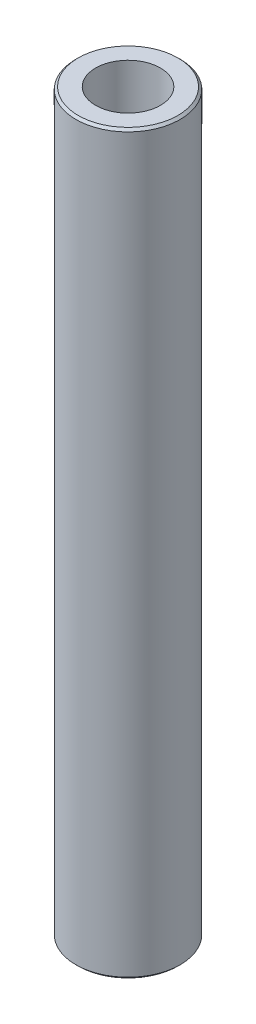
ISO-10303-21;
HEADER;
FILE_DESCRIPTION(('STEP AP214'),'2;1');
FILE_NAME('part.step','',(''),(''),'','','');
FILE_SCHEMA(('AUTOMOTIVE_DESIGN { 1 0 10303 214 1 1 1 1 }'));
ENDSEC;
DATA;
#1=APPLICATION_CONTEXT('core data for automotive mechanical design processes');
#2=APPLICATION_PROTOCOL_DEFINITION('international standard','automotive_design',2000,#1);
#3=PRODUCT_CONTEXT('',#1,'mechanical');
#4=PRODUCT('Part','Part','',(#3));
#5=PRODUCT_RELATED_PRODUCT_CATEGORY('part','',(#4));
#6=PRODUCT_DEFINITION_FORMATION('','',#4);
#7=PRODUCT_DEFINITION_CONTEXT('part definition',#1,'design');
#8=PRODUCT_DEFINITION('design','',#6,#7);
#9=PRODUCT_DEFINITION_SHAPE('','',#8);
#10=(LENGTH_UNIT() NAMED_UNIT(*) SI_UNIT(.MILLI.,.METRE.));
#11=(NAMED_UNIT(*) PLANE_ANGLE_UNIT() SI_UNIT($,.RADIAN.));
#12=(NAMED_UNIT(*) SI_UNIT($,.STERADIAN.) SOLID_ANGLE_UNIT());
#13=UNCERTAINTY_MEASURE_WITH_UNIT(LENGTH_MEASURE(1.E-05),#10,'distance_accuracy_value','');
#14=(GEOMETRIC_REPRESENTATION_CONTEXT(3) GLOBAL_UNCERTAINTY_ASSIGNED_CONTEXT((#13)) GLOBAL_UNIT_ASSIGNED_CONTEXT((#10,
#11,#12)) REPRESENTATION_CONTEXT('',''));
#15=CARTESIAN_POINT('',(0.,0.,0.));
#16=DIRECTION('',(0.,0.,1.));
#17=DIRECTION('',(1.,0.,0.));
#18=AXIS2_PLACEMENT_3D('',#15,#16,#17);
#19=CARTESIAN_POINT('',(0.,600.,0.));
#20=DIRECTION('',(0.,-1.,0.));
#21=DIRECTION('',(0.,0.,-1.));
#22=AXIS2_PLACEMENT_3D('',#19,#20,#21);
#23=CYLINDRICAL_SURFACE('',#22,42.5);
#24=CARTESIAN_POINT('',(0.,598.117307590432,0.));
#25=DIRECTION('',(0.,1.,0.));
#26=DIRECTION('',(0.,0.,1.));
#27=AXIS2_PLACEMENT_3D('',#24,#25,#26);
#28=CIRCLE('',#27,42.5);
#29=CARTESIAN_POINT('',(0.,598.117307590432,-42.5));
#30=VERTEX_POINT('',#29);
#31=EDGE_CURVE('E50',#30,#30,#28,.F.);
#32=CARTESIAN_POINT('',(0.,1.8826924095684,0.));
#33=DIRECTION('',(0.,1.,0.));
#34=DIRECTION('',(0.,0.,1.));
#35=AXIS2_PLACEMENT_3D('',#32,#33,#34);
#36=CIRCLE('',#35,42.5);
#37=CARTESIAN_POINT('',(0.,1.8826924095684,-42.5));
#38=VERTEX_POINT('',#37);
#39=EDGE_CURVE('E51',#38,#38,#36,.T.);
#40=CARTESIAN_POINT('',(0.,598.117307590432,-42.5));
#41=CARTESIAN_POINT('',(0.,591.906530348965,-42.5));
#42=CARTESIAN_POINT('',(0.,585.695753107497,-42.5));
#43=CARTESIAN_POINT('',(0.,573.274198624563,-42.5));
#44=CARTESIAN_POINT('',(0.,567.063421383095,-42.5));
#45=CARTESIAN_POINT('',(0.,554.641866900161,-42.5));
#46=CARTESIAN_POINT('',(0.,548.431089658693,-42.5));
#47=CARTESIAN_POINT('',(0.,536.009535175759,-42.5));
#48=CARTESIAN_POINT('',(0.,529.798757934291,-42.5));
#49=CARTESIAN_POINT('',(0.,517.377203451357,-42.5));
#50=CARTESIAN_POINT('',(0.,511.166426209889,-42.5));
#51=CARTESIAN_POINT('',(0.,498.744871726955,-42.5));
#52=CARTESIAN_POINT('',(0.,492.534094485487,-42.5));
#53=CARTESIAN_POINT('',(0.,480.112540002553,-42.5));
#54=CARTESIAN_POINT('',(0.,473.901762761085,-42.5));
#55=CARTESIAN_POINT('',(0.,461.480208278151,-42.5));
#56=CARTESIAN_POINT('',(0.,455.269431036683,-42.5));
#57=CARTESIAN_POINT('',(0.,442.847876553749,-42.5));
#58=CARTESIAN_POINT('',(0.,436.637099312281,-42.5));
#59=CARTESIAN_POINT('',(0.,424.215544829347,-42.5));
#60=CARTESIAN_POINT('',(0.,418.004767587879,-42.5));
#61=CARTESIAN_POINT('',(0.,405.583213104945,-42.5));
#62=CARTESIAN_POINT('',(0.,399.372435863478,-42.5));
#63=CARTESIAN_POINT('',(0.,386.950881380543,-42.5));
#64=CARTESIAN_POINT('',(0.,380.740104139075,-42.5));
#65=CARTESIAN_POINT('',(0.,368.318549656141,-42.5));
#66=CARTESIAN_POINT('',(0.,362.107772414673,-42.5));
#67=CARTESIAN_POINT('',(0.,349.686217931739,-42.5));
#68=CARTESIAN_POINT('',(0.,343.475440690272,-42.5));
#69=CARTESIAN_POINT('',(0.,331.053886207337,-42.5));
#70=CARTESIAN_POINT('',(0.,324.84310896587,-42.5));
#71=CARTESIAN_POINT('',(0.,312.421554482935,-42.5));
#72=CARTESIAN_POINT('',(0.,306.210777241468,-42.5));
#73=CARTESIAN_POINT('',(0.,293.789222758533,-42.5));
#74=CARTESIAN_POINT('',(0.,287.578445517066,-42.5));
#75=CARTESIAN_POINT('',(0.,275.156891034131,-42.5));
#76=CARTESIAN_POINT('',(0.,268.946113792664,-42.5));
#77=CARTESIAN_POINT('',(0.,256.524559309729,-42.5));
#78=CARTESIAN_POINT('',(0.,250.313782068262,-42.5));
#79=CARTESIAN_POINT('',(0.,237.892227585327,-42.5));
#80=CARTESIAN_POINT('',(0.,231.68145034386,-42.5));
#81=CARTESIAN_POINT('',(0.,219.259895860925,-42.5));
#82=CARTESIAN_POINT('',(0.,213.049118619458,-42.5));
#83=CARTESIAN_POINT('',(0.,200.627564136523,-42.5));
#84=CARTESIAN_POINT('',(0.,194.416786895056,-42.5));
#85=CARTESIAN_POINT('',(0.,181.995232412121,-42.5));
#86=CARTESIAN_POINT('',(0.,175.784455170654,-42.5));
#87=CARTESIAN_POINT('',(0.,163.362900687719,-42.5));
#88=CARTESIAN_POINT('',(0.,157.152123446252,-42.5));
#89=CARTESIAN_POINT('',(0.,144.730568963317,-42.5));
#90=CARTESIAN_POINT('',(0.,138.51979172185,-42.5));
#91=CARTESIAN_POINT('',(0.,126.098237238915,-42.5));
#92=CARTESIAN_POINT('',(0.,119.887459997448,-42.5));
#93=CARTESIAN_POINT('',(0.,107.465905514513,-42.5));
#94=CARTESIAN_POINT('',(0.,101.255128273046,-42.5));
#95=CARTESIAN_POINT('',(0.,88.833573790111,-42.5));
#96=CARTESIAN_POINT('',(0.,82.6227965486436,-42.5));
#97=CARTESIAN_POINT('',(0.,70.201242065709,-42.5));
#98=CARTESIAN_POINT('',(0.,63.9904648242417,-42.5));
#99=CARTESIAN_POINT('',(0.,51.5689103413071,-42.5));
#100=CARTESIAN_POINT('',(0.,45.3581330998398,-42.5));
#101=CARTESIAN_POINT('',(0.,32.9365786169051,-42.5));
#102=CARTESIAN_POINT('',(0.,26.7258013754377,-42.5));
#103=CARTESIAN_POINT('',(0.,14.304246892503,-42.5));
#104=CARTESIAN_POINT('',(0.,8.09346965103571,-42.5));
#105=CARTESIAN_POINT('',(0.,1.8826924095684,-42.5));
#106=B_SPLINE_CURVE_WITH_KNOTS('',3,(#40,#41,#42,#43,#44,#45,#46,#47,#48,#49,#50,#51,#52,#53,
#54,#55,#56,#57,#58,#59,#60,#61,#62,#63,#64,#65,#66,#67,#68,#69,#70,#71,#72,#73,#74,#75,#76,#77,
#78,#79,#80,#81,#82,#83,#84,#85,#86,#87,#88,#89,#90,#91,#92,#93,#94,#95,#96,#97,#98,#99,#100,
#101,#102,#103,#104,#105),.UNSPECIFIED.,.F.,.F.,(4,2,2,2,2,2,2,2,2,2,2,2,2,2,2,2,2,2,2,2,2,2,2,
2,2,2,2,2,2,2,2,2,4),(0.,18.632331724402,37.2646634488041,55.896995173206,74.5293268976079,
93.16165862201,111.793990346412,130.426322070814,149.058653795216,167.690985519618,
186.32331724402,204.955648968422,223.587980692824,242.220312417226,260.852644141628,
279.48497586603,298.117307590432,316.749639314834,335.381971039236,354.014302763638,
372.64663448804,391.278966212442,409.911297936844,428.543629661246,447.175961385648,
465.80829311005,484.440624834452,503.072956558854,521.705288283256,540.337620007658,
558.96995173206,577.602283456462,596.234615180864),.UNSPECIFIED.);
#107=EDGE_CURVE('BSEAM39',#30,#38,#106,.T.);
#108=ORIENTED_EDGE('',*,*,#31,.T.);
#109=ORIENTED_EDGE('',*,*,#39,.T.);
#110=ORIENTED_EDGE('',*,*,#107,.T.);
#111=ORIENTED_EDGE('',*,*,#107,.F.);
#112=EDGE_LOOP('',(#108,#110,#109,#111));
#113=FACE_BOUND('',#112,.T.);
#114=ADVANCED_FACE('F39',(#113),#23,.T.);
#115=CARTESIAN_POINT('',(0.,600.,0.));
#116=DIRECTION('',(0.,1.,0.));
#117=DIRECTION('',(0.,0.,1.));
#118=AXIS2_PLACEMENT_3D('',#115,#116,#117);
#119=PLANE('',#118);
#120=CARTESIAN_POINT('',(0.,600.,0.));
#121=DIRECTION('',(0.,1.,0.));
#122=DIRECTION('',(0.,0.,1.));
#123=AXIS2_PLACEMENT_3D('',#120,#121,#122);
#124=CIRCLE('',#123,40.6173075904319);
#125=CARTESIAN_POINT('',(0.,600.,-40.617307590432));
#126=VERTEX_POINT('',#125);
#127=EDGE_CURVE('E54',#126,#126,#124,.T.);
#128=ORIENTED_EDGE('',*,*,#127,.T.);
#129=EDGE_LOOP('',(#128));
#130=FACE_BOUND('',#129,.T.);
#131=CARTESIAN_POINT('',(0.,600.,0.));
#132=DIRECTION('',(0.,1.,0.));
#133=DIRECTION('',(0.,0.,1.));
#134=AXIS2_PLACEMENT_3D('',#131,#132,#133);
#135=CIRCLE('',#134,26.3985043452095);
#136=CARTESIAN_POINT('',(0.,600.,26.3985043452095));
#137=VERTEX_POINT('',#136);
#138=EDGE_CURVE('E58',#137,#137,#135,.T.);
#139=ORIENTED_EDGE('',*,*,#138,.F.);
#140=EDGE_LOOP('',(#139));
#141=FACE_BOUND('',#140,.T.);
#142=ADVANCED_FACE('F69',(#130,#141),#119,.T.);
#143=CARTESIAN_POINT('',(0.,0.,0.));
#144=DIRECTION('',(0.,1.,0.));
#145=DIRECTION('',(0.,0.,1.));
#146=AXIS2_PLACEMENT_3D('',#143,#144,#145);
#147=PLANE('',#146);
#148=CARTESIAN_POINT('',(0.,0.,0.));
#149=DIRECTION('',(0.,1.,0.));
#150=DIRECTION('',(0.,0.,1.));
#151=AXIS2_PLACEMENT_3D('',#148,#149,#150);
#152=CIRCLE('',#151,40.6173075904316);
#153=CARTESIAN_POINT('',(0.,0.,40.6173075904316));
#154=VERTEX_POINT('',#153);
#155=EDGE_CURVE('E10',#154,#154,#152,.F.);
#156=ORIENTED_EDGE('',*,*,#155,.T.);
#157=EDGE_LOOP('',(#156));
#158=FACE_BOUND('',#157,.T.);
#159=CARTESIAN_POINT('',(0.,0.,0.));
#160=DIRECTION('',(0.,1.,0.));
#161=DIRECTION('',(0.,0.,1.));
#162=AXIS2_PLACEMENT_3D('',#159,#160,#161);
#163=CIRCLE('',#162,26.3985043452095);
#164=CARTESIAN_POINT('',(0.,0.,26.3985043452095));
#165=VERTEX_POINT('',#164);
#166=EDGE_CURVE('E63',#165,#165,#163,.T.);
#167=ORIENTED_EDGE('',*,*,#166,.T.);
#168=EDGE_LOOP('',(#167));
#169=FACE_BOUND('',#168,.T.);
#170=ADVANCED_FACE('F75',(#158,#169),#147,.F.);
#171=CARTESIAN_POINT('',(0.,600.,0.));
#172=DIRECTION('',(0.,-1.,0.));
#173=DIRECTION('',(0.,0.,-1.));
#174=AXIS2_PLACEMENT_3D('',#171,#172,#173);
#175=CYLINDRICAL_SURFACE('',#174,26.3985043452095);
#176=ORIENTED_EDGE('',*,*,#138,.T.);
#177=EDGE_LOOP('',(#176));
#178=FACE_BOUND('',#177,.T.);
#179=ORIENTED_EDGE('',*,*,#166,.F.);
#180=EDGE_LOOP('',(#179));
#181=FACE_BOUND('',#180,.T.);
#182=ADVANCED_FACE('F70',(#178,#181),#175,.F.);
#183=CARTESIAN_POINT('',(0.,600.,0.));
#184=DIRECTION('',(0.,-1.,0.));
#185=DIRECTION('',(0.,0.,-1.));
#186=AXIS2_PLACEMENT_3D('',#183,#184,#185);
#187=CONICAL_SURFACE('',#186,40.6173075904319,0.785398163397485);
#188=CARTESIAN_POINT('',(0.,598.117307590432,-42.5000000000001));
#189=CARTESIAN_POINT('',(0.,598.136918969698,-42.4803886207338));
#190=CARTESIAN_POINT('',(0.,598.156530348965,-42.4607772414674));
#191=CARTESIAN_POINT('',(0.,598.195753107497,-42.4215544829347));
#192=CARTESIAN_POINT('',(0.,598.215364486764,-42.4019431036684));
#193=CARTESIAN_POINT('',(0.,598.254587245296,-42.3627203451357));
#194=CARTESIAN_POINT('',(0.,598.274198624563,-42.3431089658694));
#195=CARTESIAN_POINT('',(0.,598.313421383095,-42.3038862073367));
#196=CARTESIAN_POINT('',(0.,598.333032762362,-42.2842748280704));
#197=CARTESIAN_POINT('',(0.,598.372255520894,-42.2450520695377));
#198=CARTESIAN_POINT('',(0.,598.391866900161,-42.2254406902714));
#199=CARTESIAN_POINT('',(0.,598.431089658693,-42.1862179317387));
#200=CARTESIAN_POINT('',(0.,598.45070103796,-42.1666065524724));
#201=CARTESIAN_POINT('',(0.,598.489923796492,-42.1273837939397));
#202=CARTESIAN_POINT('',(0.,598.509535175759,-42.1077724146734));
#203=CARTESIAN_POINT('',(0.,598.548757934291,-42.0685496561407));
#204=CARTESIAN_POINT('',(0.,598.568369313558,-42.0489382768744));
#205=CARTESIAN_POINT('',(0.,598.60759207209,-42.0097155183417));
#206=CARTESIAN_POINT('',(0.,598.627203451357,-41.9901041390754));
#207=CARTESIAN_POINT('',(0.,598.666426209889,-41.9508813805427));
#208=CARTESIAN_POINT('',(0.,598.686037589156,-41.9312700012764));
#209=CARTESIAN_POINT('',(0.,598.725260347688,-41.8920472427437));
#210=CARTESIAN_POINT('',(0.,598.744871726955,-41.8724358634774));
#211=CARTESIAN_POINT('',(0.,598.784094485487,-41.8332131049447));
#212=CARTESIAN_POINT('',(0.,598.803705864754,-41.8136017256784));
#213=CARTESIAN_POINT('',(0.,598.842928623286,-41.7743789671457));
#214=CARTESIAN_POINT('',(0.,598.862540002553,-41.7547675878794));
#215=CARTESIAN_POINT('',(0.,598.901762761085,-41.7155448293467));
#216=CARTESIAN_POINT('',(0.,598.921374140352,-41.6959334500803));
#217=CARTESIAN_POINT('',(0.,598.960596898884,-41.6567106915477));
#218=CARTESIAN_POINT('',(0.,598.980208278151,-41.6370993122814));
#219=CARTESIAN_POINT('',(0.,599.019431036683,-41.5978765537487));
#220=CARTESIAN_POINT('',(0.,599.03904241595,-41.5782651744824));
#221=CARTESIAN_POINT('',(0.,599.078265174482,-41.5390424159497));
#222=CARTESIAN_POINT('',(0.,599.097876553749,-41.5194310366833));
#223=CARTESIAN_POINT('',(0.,599.137099312281,-41.4802082781507));
#224=CARTESIAN_POINT('',(0.,599.156710691548,-41.4605968988844));
#225=CARTESIAN_POINT('',(0.,599.19593345008,-41.4213741403517));
#226=CARTESIAN_POINT('',(0.,599.215544829347,-41.4017627610853));
#227=CARTESIAN_POINT('',(0.,599.254767587879,-41.3625400025527));
#228=CARTESIAN_POINT('',(0.,599.274378967146,-41.3429286232864));
#229=CARTESIAN_POINT('',(0.,599.313601725678,-41.3037058647537));
#230=CARTESIAN_POINT('',(0.,599.333213104945,-41.2840944854873));
#231=CARTESIAN_POINT('',(0.,599.372435863477,-41.2448717269547));
#232=CARTESIAN_POINT('',(0.,599.392047242744,-41.2252603476883));
#233=CARTESIAN_POINT('',(0.,599.431270001276,-41.1860375891557));
#234=CARTESIAN_POINT('',(0.,599.450881380543,-41.1664262098893));
#235=CARTESIAN_POINT('',(0.,599.490104139075,-41.1272034513567));
#236=CARTESIAN_POINT('',(0.,599.509715518342,-41.1075920720903));
#237=CARTESIAN_POINT('',(0.,599.548938276874,-41.0683693135577));
#238=CARTESIAN_POINT('',(0.,599.568549656141,-41.0487579342913));
#239=CARTESIAN_POINT('',(0.,599.607772414673,-41.0095351757586));
#240=CARTESIAN_POINT('',(0.,599.62738379394,-40.9899237964923));
#241=CARTESIAN_POINT('',(0.,599.666606552472,-40.9507010379597));
#242=CARTESIAN_POINT('',(0.,599.686217931739,-40.9310896586933));
#243=CARTESIAN_POINT('',(0.,599.725440690271,-40.8918669001606));
#244=CARTESIAN_POINT('',(0.,599.745052069538,-40.8722555208943));
#245=CARTESIAN_POINT('',(0.,599.78427482807,-40.8330327623617));
#246=CARTESIAN_POINT('',(0.,599.803886207337,-40.8134213830953));
#247=CARTESIAN_POINT('',(0.,599.843108965869,-40.7741986245626));
#248=CARTESIAN_POINT('',(0.,599.862720345136,-40.7545872452963));
#249=CARTESIAN_POINT('',(0.,599.901943103668,-40.7153644867637));
#250=CARTESIAN_POINT('',(0.,599.921554482935,-40.6957531074973));
#251=CARTESIAN_POINT('',(0.,599.960777241467,-40.6565303489646));
#252=CARTESIAN_POINT('',(0.,599.980388620734,-40.6369189696983));
#253=CARTESIAN_POINT('',(0.,600.,-40.617307590432));
#254=B_SPLINE_CURVE_WITH_KNOTS('',3,(#188,#189,#190,#191,#192,#193,#194,#195,#196,#197,#198,
#199,#200,#201,#202,#203,#204,#205,#206,#207,#208,#209,#210,#211,#212,#213,#214,#215,#216,#217,
#218,#219,#220,#221,#222,#223,#224,#225,#226,#227,#228,#229,#230,#231,#232,#233,#234,#235,#236,
#237,#238,#239,#240,#241,#242,#243,#244,#245,#246,#247,#248,#249,#250,#251,#252,#253),
.UNSPECIFIED.,.F.,.F.,(4,2,2,2,2,2,2,2,2,2,2,2,2,2,2,2,2,2,2,2,2,2,2,2,2,2,2,2,2,2,2,2,4),(0.,
0.0832040356059155,0.166408071211752,0.249612106817668,0.332816142423505,0.416020178029425,
0.499224213635262,0.582428249241178,0.665632284847015,0.74883632045293,0.832040356058767,
0.915244391664683,0.99844842727052,1.08165246287644,1.16485649848228,1.24806053408819,
1.33126456969403,1.41446860529987,1.49767264090578,1.58087667651162,1.66408071211753,
1.74728474772338,1.83048878332929,1.91369281893513,1.99689685454104,2.08010089014688,
2.1633049257528,2.24650896135863,2.32971299696456,2.41291703257039,2.49612106817631,
2.57932510378214,2.66252913938806),.UNSPECIFIED.);
#255=EDGE_CURVE('BSEAM81',#30,#126,#254,.T.);
#256=ORIENTED_EDGE('',*,*,#31,.F.);
#257=ORIENTED_EDGE('',*,*,#127,.F.);
#258=ORIENTED_EDGE('',*,*,#255,.T.);
#259=ORIENTED_EDGE('',*,*,#255,.F.);
#260=EDGE_LOOP('',(#256,#258,#257,#259));
#261=FACE_BOUND('',#260,.T.);
#262=ADVANCED_FACE('F81',(#261),#187,.T.);
#263=CARTESIAN_POINT('',(0.,1.8826924095684,0.));
#264=DIRECTION('',(0.,1.,0.));
#265=DIRECTION('',(0.,0.,1.));
#266=AXIS2_PLACEMENT_3D('',#263,#264,#265);
#267=CONICAL_SURFACE('',#266,42.5,0.785398163397441);
#268=ORIENTED_EDGE('',*,*,#155,.F.);
#269=EDGE_LOOP('',(#268));
#270=FACE_BOUND('',#269,.T.);
#271=ORIENTED_EDGE('',*,*,#39,.F.);
#272=EDGE_LOOP('',(#271));
#273=FACE_BOUND('',#272,.T.);
#274=ADVANCED_FACE('F45',(#270,#273),#267,.T.);
#275=CLOSED_SHELL('',(#114,#142,#170,#182,#262,#274));
#276=MANIFOLD_SOLID_BREP('B2',#275);
#277=ADVANCED_BREP_SHAPE_REPRESENTATION('',(#18,#276),#14);
#278=SHAPE_DEFINITION_REPRESENTATION(#9,#277);
ENDSEC;
END-ISO-10303-21;
